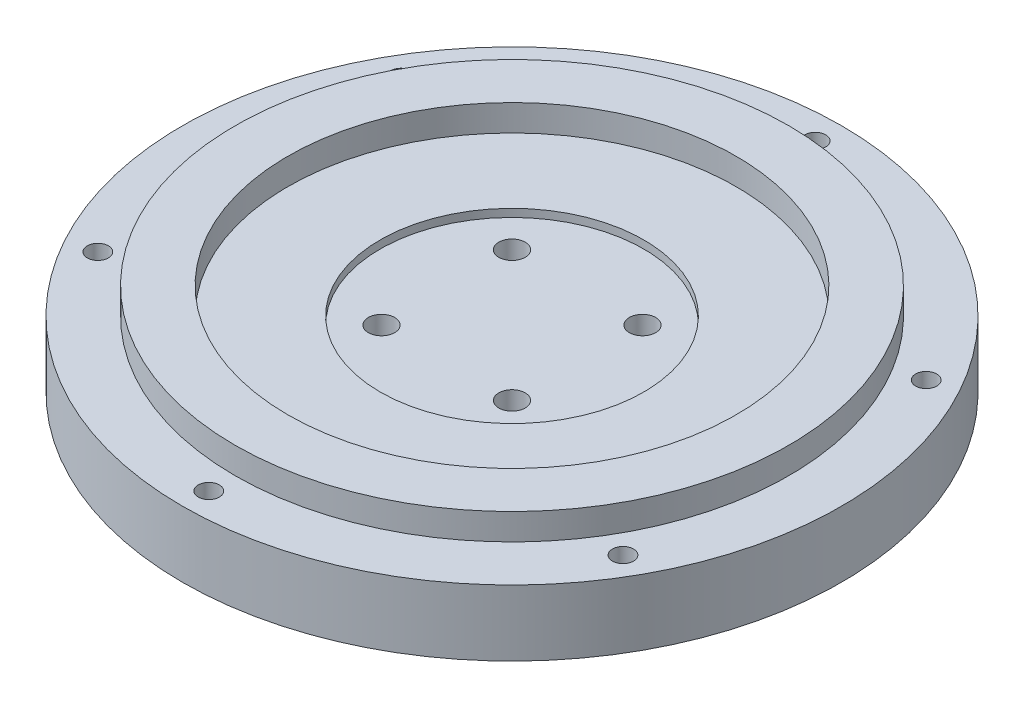
ISO-10303-21;
HEADER;
FILE_DESCRIPTION(('STEP AP214'),'2;1');
FILE_NAME('part.step','',(''),(''),'','','');
FILE_SCHEMA(('AUTOMOTIVE_DESIGN { 1 0 10303 214 1 1 1 1 }'));
ENDSEC;
DATA;
#1=APPLICATION_CONTEXT('core data for automotive mechanical design processes');
#2=APPLICATION_PROTOCOL_DEFINITION('international standard','automotive_design',2000,#1);
#3=PRODUCT_CONTEXT('',#1,'mechanical');
#4=PRODUCT('Part','Part','',(#3));
#5=PRODUCT_RELATED_PRODUCT_CATEGORY('part','',(#4));
#6=PRODUCT_DEFINITION_FORMATION('','',#4);
#7=PRODUCT_DEFINITION_CONTEXT('part definition',#1,'design');
#8=PRODUCT_DEFINITION('design','',#6,#7);
#9=PRODUCT_DEFINITION_SHAPE('','',#8);
#10=(LENGTH_UNIT() NAMED_UNIT(*) SI_UNIT(.MILLI.,.METRE.));
#11=(NAMED_UNIT(*) PLANE_ANGLE_UNIT() SI_UNIT($,.RADIAN.));
#12=(NAMED_UNIT(*) SI_UNIT($,.STERADIAN.) SOLID_ANGLE_UNIT());
#13=UNCERTAINTY_MEASURE_WITH_UNIT(LENGTH_MEASURE(1.E-05),#10,'distance_accuracy_value','');
#14=(GEOMETRIC_REPRESENTATION_CONTEXT(3) GLOBAL_UNCERTAINTY_ASSIGNED_CONTEXT((#13)) GLOBAL_UNIT_ASSIGNED_CONTEXT((#10,
#11,#12)) REPRESENTATION_CONTEXT('',''));
#15=CARTESIAN_POINT('',(0.,0.,0.));
#16=DIRECTION('',(0.,0.,1.));
#17=DIRECTION('',(1.,0.,0.));
#18=AXIS2_PLACEMENT_3D('',#15,#16,#17);
#19=CARTESIAN_POINT('',(0.,25.,0.));
#20=DIRECTION('',(0.,1.,0.));
#21=DIRECTION('',(0.,0.,1.));
#22=AXIS2_PLACEMENT_3D('',#19,#20,#21);
#23=PLANE('',#22);
#24=CARTESIAN_POINT('',(0.,25.,0.));
#25=DIRECTION('',(0.,1.,0.));
#26=DIRECTION('',(0.,0.,1.));
#27=AXIS2_PLACEMENT_3D('',#24,#25,#26);
#28=CIRCLE('',#27,50.);
#29=CARTESIAN_POINT('',(0.,25.,50.));
#30=VERTEX_POINT('',#29);
#31=EDGE_CURVE('E54',#30,#30,#28,.T.);
#32=ORIENTED_EDGE('',*,*,#31,.F.);
#33=EDGE_LOOP('',(#32));
#34=FACE_BOUND('',#33,.T.);
#35=CARTESIAN_POINT('',(0.,25.,0.));
#36=DIRECTION('',(0.,1.,0.));
#37=DIRECTION('',(0.,0.,1.));
#38=AXIS2_PLACEMENT_3D('',#35,#36,#37);
#39=CIRCLE('',#38,85.);
#40=CARTESIAN_POINT('',(0.,25.,85.));
#41=VERTEX_POINT('',#40);
#42=EDGE_CURVE('E414',#41,#41,#39,.T.);
#43=ORIENTED_EDGE('',*,*,#42,.T.);
#44=EDGE_LOOP('',(#43));
#45=FACE_BOUND('',#44,.T.);
#46=ADVANCED_FACE('F32',(#34,#45),#23,.T.);
#47=CARTESIAN_POINT('',(-24.7487373415292,39.142135623731,24.7487373415292));
#48=DIRECTION('',(0.,-1.,0.));
#49=DIRECTION('',(0.,0.,-1.));
#50=AXIS2_PLACEMENT_3D('',#47,#48,#49);
#51=CYLINDRICAL_SURFACE('',#50,5.);
#52=CARTESIAN_POINT('',(-24.7487373415292,10.,24.7487373415292));
#53=DIRECTION('',(0.,-1.,0.));
#54=DIRECTION('',(0.,0.,-1.));
#55=AXIS2_PLACEMENT_3D('',#52,#53,#54);
#56=CIRCLE('',#55,5.);
#57=CARTESIAN_POINT('',(-24.7487373415292,10.,19.7487373415292));
#58=VERTEX_POINT('',#57);
#59=EDGE_CURVE('E70',#58,#58,#56,.T.);
#60=ORIENTED_EDGE('',*,*,#59,.T.);
#61=EDGE_LOOP('',(#60));
#62=FACE_BOUND('',#61,.T.);
#63=CARTESIAN_POINT('',(-24.7487373415292,22.,24.7487373415292));
#64=DIRECTION('',(0.,1.,0.));
#65=DIRECTION('',(0.,0.,1.));
#66=AXIS2_PLACEMENT_3D('',#63,#64,#65);
#67=CIRCLE('',#66,5.);
#68=CARTESIAN_POINT('',(-24.7487373415292,22.,29.7487373415292));
#69=VERTEX_POINT('',#68);
#70=EDGE_CURVE('E63',#69,#69,#67,.F.);
#71=ORIENTED_EDGE('',*,*,#70,.F.);
#72=EDGE_LOOP('',(#71));
#73=FACE_BOUND('',#72,.T.);
#74=ADVANCED_FACE('F175',(#62,#73),#51,.F.);
#75=CARTESIAN_POINT('',(24.7487373415292,39.142135623731,24.7487373415292));
#76=DIRECTION('',(0.,-1.,0.));
#77=DIRECTION('',(0.,0.,-1.));
#78=AXIS2_PLACEMENT_3D('',#75,#76,#77);
#79=CYLINDRICAL_SURFACE('',#78,5.);
#80=CARTESIAN_POINT('',(24.7487373415292,10.,24.7487373415292));
#81=DIRECTION('',(0.,-1.,0.));
#82=DIRECTION('',(0.,0.,-1.));
#83=AXIS2_PLACEMENT_3D('',#80,#81,#82);
#84=CIRCLE('',#83,5.);
#85=CARTESIAN_POINT('',(24.7487373415292,10.,19.7487373415292));
#86=VERTEX_POINT('',#85);
#87=EDGE_CURVE('E67',#86,#86,#84,.T.);
#88=ORIENTED_EDGE('',*,*,#87,.T.);
#89=EDGE_LOOP('',(#88));
#90=FACE_BOUND('',#89,.T.);
#91=CARTESIAN_POINT('',(24.7487373415292,22.,24.7487373415292));
#92=DIRECTION('',(0.,1.,0.));
#93=DIRECTION('',(0.,0.,1.));
#94=AXIS2_PLACEMENT_3D('',#91,#92,#93);
#95=CIRCLE('',#94,5.);
#96=CARTESIAN_POINT('',(24.7487373415292,22.,29.7487373415292));
#97=VERTEX_POINT('',#96);
#98=EDGE_CURVE('E60',#97,#97,#95,.F.);
#99=ORIENTED_EDGE('',*,*,#98,.F.);
#100=EDGE_LOOP('',(#99));
#101=FACE_BOUND('',#100,.T.);
#102=ADVANCED_FACE('F181',(#90,#101),#79,.F.);
#103=CARTESIAN_POINT('',(24.7487373415292,39.142135623731,-24.7487373415292));
#104=DIRECTION('',(0.,-1.,0.));
#105=DIRECTION('',(0.,0.,-1.));
#106=AXIS2_PLACEMENT_3D('',#103,#104,#105);
#107=CYLINDRICAL_SURFACE('',#106,5.);
#108=CARTESIAN_POINT('',(24.7487373415292,10.,-24.7487373415292));
#109=DIRECTION('',(0.,-1.,0.));
#110=DIRECTION('',(0.,0.,-1.));
#111=AXIS2_PLACEMENT_3D('',#108,#109,#110);
#112=CIRCLE('',#111,5.);
#113=CARTESIAN_POINT('',(24.7487373415292,10.,-29.7487373415292));
#114=VERTEX_POINT('',#113);
#115=EDGE_CURVE('E71',#114,#114,#112,.T.);
#116=ORIENTED_EDGE('',*,*,#115,.T.);
#117=EDGE_LOOP('',(#116));
#118=FACE_BOUND('',#117,.T.);
#119=CARTESIAN_POINT('',(24.7487373415292,22.,-24.7487373415292));
#120=DIRECTION('',(0.,1.,0.));
#121=DIRECTION('',(0.,0.,1.));
#122=AXIS2_PLACEMENT_3D('',#119,#120,#121);
#123=CIRCLE('',#122,5.);
#124=CARTESIAN_POINT('',(24.7487373415292,22.,-19.7487373415292));
#125=VERTEX_POINT('',#124);
#126=EDGE_CURVE('E57',#125,#125,#123,.F.);
#127=ORIENTED_EDGE('',*,*,#126,.F.);
#128=EDGE_LOOP('',(#127));
#129=FACE_BOUND('',#128,.T.);
#130=ADVANCED_FACE('F193',(#118,#129),#107,.F.);
#131=CARTESIAN_POINT('',(-24.7487373415292,39.142135623731,-24.7487373415292));
#132=DIRECTION('',(0.,-1.,0.));
#133=DIRECTION('',(0.,0.,-1.));
#134=AXIS2_PLACEMENT_3D('',#131,#132,#133);
#135=CYLINDRICAL_SURFACE('',#134,5.);
#136=CARTESIAN_POINT('',(-24.7487373415292,10.,-24.7487373415292));
#137=DIRECTION('',(0.,-1.,0.));
#138=DIRECTION('',(0.,0.,-1.));
#139=AXIS2_PLACEMENT_3D('',#136,#137,#138);
#140=CIRCLE('',#139,5.);
#141=CARTESIAN_POINT('',(-24.7487373415292,10.,-29.7487373415292));
#142=VERTEX_POINT('',#141);
#143=EDGE_CURVE('E66',#142,#142,#140,.T.);
#144=ORIENTED_EDGE('',*,*,#143,.T.);
#145=EDGE_LOOP('',(#144));
#146=FACE_BOUND('',#145,.T.);
#147=CARTESIAN_POINT('',(-24.7487373415292,22.,-24.7487373415292));
#148=DIRECTION('',(0.,1.,0.));
#149=DIRECTION('',(0.,0.,1.));
#150=AXIS2_PLACEMENT_3D('',#147,#148,#149);
#151=CIRCLE('',#150,5.);
#152=CARTESIAN_POINT('',(-24.7487373415292,22.,-19.7487373415292));
#153=VERTEX_POINT('',#152);
#154=EDGE_CURVE('E36',#153,#153,#151,.F.);
#155=ORIENTED_EDGE('',*,*,#154,.F.);
#156=EDGE_LOOP('',(#155));
#157=FACE_BOUND('',#156,.T.);
#158=ADVANCED_FACE('F188',(#146,#157),#135,.F.);
#159=CARTESIAN_POINT('',(0.,25.,0.));
#160=DIRECTION('',(0.,1.,0.));
#161=DIRECTION('',(0.,0.,1.));
#162=AXIS2_PLACEMENT_3D('',#159,#160,#161);
#163=CIRCLE('',#162,105.);
#164=CARTESIAN_POINT('',(0.,25.,105.));
#165=VERTEX_POINT('',#164);
#166=EDGE_CURVE('E10',#165,#165,#163,.T.);
#167=ORIENTED_EDGE('',*,*,#166,.F.);
#168=EDGE_LOOP('',(#167));
#169=FACE_BOUND('',#168,.T.);
#170=CARTESIAN_POINT('',(-99.5929214352031,25.,57.5000000000043));
#171=DIRECTION('',(0.,1.,0.));
#172=DIRECTION('',(0.,0.,1.));
#173=AXIS2_PLACEMENT_3D('',#170,#171,#172);
#174=CIRCLE('',#173,4.00000000001161);
#175=CARTESIAN_POINT('',(-99.5929214352031,25.,61.5000000000159));
#176=VERTEX_POINT('',#175);
#177=EDGE_CURVE('E109',#176,#176,#174,.T.);
#178=ORIENTED_EDGE('',*,*,#177,.F.);
#179=EDGE_LOOP('',(#178));
#180=FACE_BOUND('',#179,.T.);
#181=CARTESIAN_POINT('',(99.5929214352178,25.,57.4999999999958));
#182=DIRECTION('',(0.,1.,0.));
#183=DIRECTION('',(0.,0.,1.));
#184=AXIS2_PLACEMENT_3D('',#181,#182,#183);
#185=CIRCLE('',#184,4.00000000000822);
#186=CARTESIAN_POINT('',(99.5929214352178,25.,61.500000000004));
#187=VERTEX_POINT('',#186);
#188=EDGE_CURVE('E121',#187,#187,#185,.T.);
#189=ORIENTED_EDGE('',*,*,#188,.F.);
#190=EDGE_LOOP('',(#189));
#191=FACE_BOUND('',#190,.T.);
#192=CARTESIAN_POINT('',(0.,25.,-115.));
#193=DIRECTION('',(0.,1.,0.));
#194=DIRECTION('',(0.,0.,1.));
#195=AXIS2_PLACEMENT_3D('',#192,#193,#194);
#196=CIRCLE('',#195,4.);
#197=CARTESIAN_POINT('',(0.,25.,-111.));
#198=VERTEX_POINT('',#197);
#199=EDGE_CURVE('E133',#198,#198,#196,.T.);
#200=ORIENTED_EDGE('',*,*,#199,.F.);
#201=EDGE_LOOP('',(#200));
#202=FACE_BOUND('',#201,.T.);
#203=CARTESIAN_POINT('',(0.,25.,0.));
#204=DIRECTION('',(0.,1.,0.));
#205=DIRECTION('',(0.,0.,1.));
#206=AXIS2_PLACEMENT_3D('',#203,#204,#205);
#207=CIRCLE('',#206,125.);
#208=CARTESIAN_POINT('',(0.,25.,125.));
#209=VERTEX_POINT('',#208);
#210=EDGE_CURVE('E40',#209,#209,#207,.T.);
#211=ORIENTED_EDGE('',*,*,#210,.T.);
#212=EDGE_LOOP('',(#211));
#213=FACE_BOUND('',#212,.T.);
#214=CARTESIAN_POINT('',(99.5929214352129,25.,-57.5000000000043));
#215=DIRECTION('',(0.,1.,0.));
#216=DIRECTION('',(0.,0.,1.));
#217=AXIS2_PLACEMENT_3D('',#214,#215,#216);
#218=CIRCLE('',#217,4.00000000000314);
#219=CARTESIAN_POINT('',(99.5929214352129,25.,-53.5000000000011));
#220=VERTEX_POINT('',#219);
#221=EDGE_CURVE('E127',#220,#220,#218,.T.);
#222=ORIENTED_EDGE('',*,*,#221,.F.);
#223=EDGE_LOOP('',(#222));
#224=FACE_BOUND('',#223,.T.);
#225=CARTESIAN_POINT('',(9.77732287710899E-12,25.,115.));
#226=DIRECTION('',(0.,1.,0.));
#227=DIRECTION('',(0.,0.,1.));
#228=AXIS2_PLACEMENT_3D('',#225,#226,#227);
#229=CIRCLE('',#228,4.00000000001225);
#230=CARTESIAN_POINT('',(9.77732287710899E-12,25.,119.000000000012));
#231=VERTEX_POINT('',#230);
#232=EDGE_CURVE('E115',#231,#231,#229,.T.);
#233=ORIENTED_EDGE('',*,*,#232,.F.);
#234=EDGE_LOOP('',(#233));
#235=FACE_BOUND('',#234,.T.);
#236=CARTESIAN_POINT('',(-99.5929214352081,25.,-57.4999999999957));
#237=DIRECTION('',(0.,1.,0.));
#238=DIRECTION('',(0.,0.,1.));
#239=AXIS2_PLACEMENT_3D('',#236,#237,#238);
#240=CIRCLE('',#239,4.00000000000591);
#241=CARTESIAN_POINT('',(-99.5929214352081,25.,-53.4999999999898));
#242=VERTEX_POINT('',#241);
#243=EDGE_CURVE('E103',#242,#242,#240,.T.);
#244=ORIENTED_EDGE('',*,*,#243,.F.);
#245=EDGE_LOOP('',(#244));
#246=FACE_BOUND('',#245,.T.);
#247=ADVANCED_FACE('F144',(#169,#180,#191,#202,#213,#224,#235,#246),#23,.T.);
#248=CARTESIAN_POINT('',(0.,0.,0.));
#249=DIRECTION('',(0.,1.,0.));
#250=DIRECTION('',(0.,0.,1.));
#251=AXIS2_PLACEMENT_3D('',#248,#249,#250);
#252=PLANE('',#251);
#253=CARTESIAN_POINT('',(-24.7487373415292,0.,-24.7487373415292));
#254=DIRECTION('',(0.,-1.,0.));
#255=DIRECTION('',(0.,0.,-1.));
#256=AXIS2_PLACEMENT_3D('',#253,#254,#255);
#257=CIRCLE('',#256,9.);
#258=CARTESIAN_POINT('',(-24.7487373415292,0.,-33.7487373415292));
#259=VERTEX_POINT('',#258);
#260=EDGE_CURVE('E78',#259,#259,#257,.T.);
#261=ORIENTED_EDGE('',*,*,#260,.F.);
#262=EDGE_LOOP('',(#261));
#263=FACE_BOUND('',#262,.T.);
#264=CARTESIAN_POINT('',(24.7487373415292,0.,-24.7487373415292));
#265=DIRECTION('',(0.,-1.,0.));
#266=DIRECTION('',(0.,0.,-1.));
#267=AXIS2_PLACEMENT_3D('',#264,#265,#266);
#268=CIRCLE('',#267,9.);
#269=CARTESIAN_POINT('',(24.7487373415292,0.,-33.7487373415292));
#270=VERTEX_POINT('',#269);
#271=EDGE_CURVE('E89',#270,#270,#268,.T.);
#272=ORIENTED_EDGE('',*,*,#271,.F.);
#273=EDGE_LOOP('',(#272));
#274=FACE_BOUND('',#273,.T.);
#275=CARTESIAN_POINT('',(24.7487373415292,0.,24.7487373415292));
#276=DIRECTION('',(0.,-1.,0.));
#277=DIRECTION('',(0.,0.,-1.));
#278=AXIS2_PLACEMENT_3D('',#275,#276,#277);
#279=CIRCLE('',#278,9.);
#280=CARTESIAN_POINT('',(24.7487373415292,0.,15.7487373415292));
#281=VERTEX_POINT('',#280);
#282=EDGE_CURVE('E83',#281,#281,#279,.T.);
#283=ORIENTED_EDGE('',*,*,#282,.F.);
#284=EDGE_LOOP('',(#283));
#285=FACE_BOUND('',#284,.T.);
#286=CARTESIAN_POINT('',(-24.7487373415292,0.,24.7487373415292));
#287=DIRECTION('',(0.,-1.,0.));
#288=DIRECTION('',(0.,0.,-1.));
#289=AXIS2_PLACEMENT_3D('',#286,#287,#288);
#290=CIRCLE('',#289,9.);
#291=CARTESIAN_POINT('',(-24.7487373415292,0.,15.7487373415292));
#292=VERTEX_POINT('',#291);
#293=EDGE_CURVE('E82',#292,#292,#290,.T.);
#294=ORIENTED_EDGE('',*,*,#293,.F.);
#295=EDGE_LOOP('',(#294));
#296=FACE_BOUND('',#295,.T.);
#297=CARTESIAN_POINT('',(0.,0.,0.));
#298=DIRECTION('',(0.,1.,0.));
#299=DIRECTION('',(0.,0.,1.));
#300=AXIS2_PLACEMENT_3D('',#297,#298,#299);
#301=CIRCLE('',#300,125.);
#302=CARTESIAN_POINT('',(0.,0.,125.));
#303=VERTEX_POINT('',#302);
#304=EDGE_CURVE('E45',#303,#303,#301,.T.);
#305=ORIENTED_EDGE('',*,*,#304,.F.);
#306=EDGE_LOOP('',(#305));
#307=FACE_BOUND('',#306,.T.);
#308=CARTESIAN_POINT('',(0.,0.,-115.));
#309=DIRECTION('',(0.,1.,0.));
#310=DIRECTION('',(0.,0.,1.));
#311=AXIS2_PLACEMENT_3D('',#308,#309,#310);
#312=CIRCLE('',#311,4.);
#313=CARTESIAN_POINT('',(0.,0.,-111.));
#314=VERTEX_POINT('',#313);
#315=EDGE_CURVE('E130',#314,#314,#312,.T.);
#316=ORIENTED_EDGE('',*,*,#315,.T.);
#317=EDGE_LOOP('',(#316));
#318=FACE_BOUND('',#317,.T.);
#319=CARTESIAN_POINT('',(99.5929214352129,0.,-57.5000000000043));
#320=DIRECTION('',(0.,1.,0.));
#321=DIRECTION('',(0.,0.,1.));
#322=AXIS2_PLACEMENT_3D('',#319,#320,#321);
#323=CIRCLE('',#322,4.00000000000314);
#324=CARTESIAN_POINT('',(99.5929214352129,0.,-53.5000000000011));
#325=VERTEX_POINT('',#324);
#326=EDGE_CURVE('E124',#325,#325,#323,.T.);
#327=ORIENTED_EDGE('',*,*,#326,.T.);
#328=EDGE_LOOP('',(#327));
#329=FACE_BOUND('',#328,.T.);
#330=CARTESIAN_POINT('',(99.5929214352178,0.,57.4999999999958));
#331=DIRECTION('',(0.,1.,0.));
#332=DIRECTION('',(0.,0.,1.));
#333=AXIS2_PLACEMENT_3D('',#330,#331,#332);
#334=CIRCLE('',#333,4.00000000000822);
#335=CARTESIAN_POINT('',(99.5929214352178,0.,61.500000000004));
#336=VERTEX_POINT('',#335);
#337=EDGE_CURVE('E118',#336,#336,#334,.T.);
#338=ORIENTED_EDGE('',*,*,#337,.T.);
#339=EDGE_LOOP('',(#338));
#340=FACE_BOUND('',#339,.T.);
#341=CARTESIAN_POINT('',(9.77732287710899E-12,0.,115.));
#342=DIRECTION('',(0.,1.,0.));
#343=DIRECTION('',(0.,0.,1.));
#344=AXIS2_PLACEMENT_3D('',#341,#342,#343);
#345=CIRCLE('',#344,4.00000000001225);
#346=CARTESIAN_POINT('',(9.77732287710899E-12,0.,119.000000000012));
#347=VERTEX_POINT('',#346);
#348=EDGE_CURVE('E112',#347,#347,#345,.T.);
#349=ORIENTED_EDGE('',*,*,#348,.T.);
#350=EDGE_LOOP('',(#349));
#351=FACE_BOUND('',#350,.T.);
#352=CARTESIAN_POINT('',(-99.5929214352031,0.,57.5000000000043));
#353=DIRECTION('',(0.,1.,0.));
#354=DIRECTION('',(0.,0.,1.));
#355=AXIS2_PLACEMENT_3D('',#352,#353,#354);
#356=CIRCLE('',#355,4.00000000001161);
#357=CARTESIAN_POINT('',(-99.5929214352031,0.,61.5000000000159));
#358=VERTEX_POINT('',#357);
#359=EDGE_CURVE('E106',#358,#358,#356,.T.);
#360=ORIENTED_EDGE('',*,*,#359,.T.);
#361=EDGE_LOOP('',(#360));
#362=FACE_BOUND('',#361,.T.);
#363=CARTESIAN_POINT('',(-99.5929214352081,0.,-57.4999999999957));
#364=DIRECTION('',(0.,1.,0.));
#365=DIRECTION('',(0.,0.,1.));
#366=AXIS2_PLACEMENT_3D('',#363,#364,#365);
#367=CIRCLE('',#366,4.00000000000591);
#368=CARTESIAN_POINT('',(-99.5929214352081,0.,-53.4999999999898));
#369=VERTEX_POINT('',#368);
#370=EDGE_CURVE('E100',#369,#369,#367,.T.);
#371=ORIENTED_EDGE('',*,*,#370,.T.);
#372=EDGE_LOOP('',(#371));
#373=FACE_BOUND('',#372,.T.);
#374=ADVANCED_FACE('F141',(#263,#274,#285,#296,#307,#318,#329,#340,#351,#362,#373),#252,.F.);
#375=CARTESIAN_POINT('',(0.,25.,0.));
#376=DIRECTION('',(0.,-1.,0.));
#377=DIRECTION('',(0.,0.,-1.));
#378=AXIS2_PLACEMENT_3D('',#375,#376,#377);
#379=CYLINDRICAL_SURFACE('',#378,125.);
#380=ORIENTED_EDGE('',*,*,#210,.F.);
#381=EDGE_LOOP('',(#380));
#382=FACE_BOUND('',#381,.T.);
#383=ORIENTED_EDGE('',*,*,#304,.T.);
#384=EDGE_LOOP('',(#383));
#385=FACE_BOUND('',#384,.T.);
#386=ADVANCED_FACE('F34',(#382,#385),#379,.T.);
#387=CARTESIAN_POINT('',(0.,25.,-115.));
#388=DIRECTION('',(0.,-1.,0.));
#389=DIRECTION('',(0.,0.,-1.));
#390=AXIS2_PLACEMENT_3D('',#387,#388,#389);
#391=CYLINDRICAL_SURFACE('',#390,4.);
#392=ORIENTED_EDGE('',*,*,#199,.T.);
#393=EDGE_LOOP('',(#392));
#394=FACE_BOUND('',#393,.T.);
#395=ORIENTED_EDGE('',*,*,#315,.F.);
#396=EDGE_LOOP('',(#395));
#397=FACE_BOUND('',#396,.T.);
#398=ADVANCED_FACE('F223',(#394,#397),#391,.F.);
#399=CARTESIAN_POINT('',(99.5929214352129,25.,-57.5000000000043));
#400=DIRECTION('',(0.,-1.,0.));
#401=DIRECTION('',(0.,0.,-1.));
#402=AXIS2_PLACEMENT_3D('',#399,#400,#401);
#403=CYLINDRICAL_SURFACE('',#402,4.00000000000314);
#404=ORIENTED_EDGE('',*,*,#221,.T.);
#405=EDGE_LOOP('',(#404));
#406=FACE_BOUND('',#405,.T.);
#407=ORIENTED_EDGE('',*,*,#326,.F.);
#408=EDGE_LOOP('',(#407));
#409=FACE_BOUND('',#408,.T.);
#410=ADVANCED_FACE('F218',(#406,#409),#403,.F.);
#411=CARTESIAN_POINT('',(99.5929214352178,25.,57.4999999999958));
#412=DIRECTION('',(0.,-1.,0.));
#413=DIRECTION('',(0.,0.,-1.));
#414=AXIS2_PLACEMENT_3D('',#411,#412,#413);
#415=CYLINDRICAL_SURFACE('',#414,4.00000000000822);
#416=ORIENTED_EDGE('',*,*,#188,.T.);
#417=EDGE_LOOP('',(#416));
#418=FACE_BOUND('',#417,.T.);
#419=ORIENTED_EDGE('',*,*,#337,.F.);
#420=EDGE_LOOP('',(#419));
#421=FACE_BOUND('',#420,.T.);
#422=ADVANCED_FACE('F213',(#418,#421),#415,.F.);
#423=CARTESIAN_POINT('',(9.77732287710899E-12,25.,115.));
#424=DIRECTION('',(0.,-1.,0.));
#425=DIRECTION('',(0.,0.,-1.));
#426=AXIS2_PLACEMENT_3D('',#423,#424,#425);
#427=CYLINDRICAL_SURFACE('',#426,4.00000000001225);
#428=ORIENTED_EDGE('',*,*,#232,.T.);
#429=EDGE_LOOP('',(#428));
#430=FACE_BOUND('',#429,.T.);
#431=ORIENTED_EDGE('',*,*,#348,.F.);
#432=EDGE_LOOP('',(#431));
#433=FACE_BOUND('',#432,.T.);
#434=ADVANCED_FACE('F171',(#430,#433),#427,.F.);
#435=CARTESIAN_POINT('',(-99.5929214352031,25.,57.5000000000043));
#436=DIRECTION('',(0.,-1.,0.));
#437=DIRECTION('',(0.,0.,-1.));
#438=AXIS2_PLACEMENT_3D('',#435,#436,#437);
#439=CYLINDRICAL_SURFACE('',#438,4.00000000001161);
#440=ORIENTED_EDGE('',*,*,#177,.T.);
#441=EDGE_LOOP('',(#440));
#442=FACE_BOUND('',#441,.T.);
#443=ORIENTED_EDGE('',*,*,#359,.F.);
#444=EDGE_LOOP('',(#443));
#445=FACE_BOUND('',#444,.T.);
#446=ADVANCED_FACE('F161',(#442,#445),#439,.F.);
#447=CARTESIAN_POINT('',(-99.5929214352081,25.,-57.4999999999957));
#448=DIRECTION('',(0.,-1.,0.));
#449=DIRECTION('',(0.,0.,-1.));
#450=AXIS2_PLACEMENT_3D('',#447,#448,#449);
#451=CYLINDRICAL_SURFACE('',#450,4.00000000000591);
#452=ORIENTED_EDGE('',*,*,#243,.T.);
#453=EDGE_LOOP('',(#452));
#454=FACE_BOUND('',#453,.T.);
#455=ORIENTED_EDGE('',*,*,#370,.F.);
#456=EDGE_LOOP('',(#455));
#457=FACE_BOUND('',#456,.T.);
#458=ADVANCED_FACE('F158',(#454,#457),#451,.F.);
#459=CARTESIAN_POINT('',(-24.7487373415292,10.,24.7487373415292));
#460=DIRECTION('',(0.,-1.,0.));
#461=DIRECTION('',(0.,0.,-1.));
#462=AXIS2_PLACEMENT_3D('',#459,#460,#461);
#463=CYLINDRICAL_SURFACE('',#462,9.);
#464=CARTESIAN_POINT('',(-24.7487373415292,10.,24.7487373415292));
#465=DIRECTION('',(0.,-1.,0.));
#466=DIRECTION('',(0.,0.,-1.));
#467=AXIS2_PLACEMENT_3D('',#464,#465,#466);
#468=CIRCLE('',#467,9.);
#469=CARTESIAN_POINT('',(-24.7487373415292,10.,15.7487373415292));
#470=VERTEX_POINT('',#469);
#471=EDGE_CURVE('E97',#470,#470,#468,.T.);
#472=ORIENTED_EDGE('',*,*,#471,.F.);
#473=EDGE_LOOP('',(#472));
#474=FACE_BOUND('',#473,.T.);
#475=ORIENTED_EDGE('',*,*,#293,.T.);
#476=EDGE_LOOP('',(#475));
#477=FACE_BOUND('',#476,.T.);
#478=ADVANCED_FACE('F160',(#474,#477),#463,.F.);
#479=CARTESIAN_POINT('',(-24.7487373415292,10.,24.7487373415292));
#480=DIRECTION('',(0.,-1.,0.));
#481=DIRECTION('',(0.,0.,-1.));
#482=AXIS2_PLACEMENT_3D('',#479,#480,#481);
#483=PLANE('',#482);
#484=ORIENTED_EDGE('',*,*,#59,.F.);
#485=EDGE_LOOP('',(#484));
#486=FACE_BOUND('',#485,.T.);
#487=ORIENTED_EDGE('',*,*,#471,.T.);
#488=EDGE_LOOP('',(#487));
#489=FACE_BOUND('',#488,.T.);
#490=ADVANCED_FACE('F168',(#486,#489),#483,.T.);
#491=CARTESIAN_POINT('',(24.7487373415292,10.,24.7487373415292));
#492=DIRECTION('',(0.,-1.,0.));
#493=DIRECTION('',(0.,0.,-1.));
#494=AXIS2_PLACEMENT_3D('',#491,#492,#493);
#495=CYLINDRICAL_SURFACE('',#494,9.);
#496=CARTESIAN_POINT('',(24.7487373415292,10.,24.7487373415292));
#497=DIRECTION('',(0.,-1.,0.));
#498=DIRECTION('',(0.,0.,-1.));
#499=AXIS2_PLACEMENT_3D('',#496,#497,#498);
#500=CIRCLE('',#499,9.);
#501=CARTESIAN_POINT('',(24.7487373415292,10.,15.7487373415292));
#502=VERTEX_POINT('',#501);
#503=EDGE_CURVE('E79',#502,#502,#500,.T.);
#504=ORIENTED_EDGE('',*,*,#503,.F.);
#505=EDGE_LOOP('',(#504));
#506=FACE_BOUND('',#505,.T.);
#507=ORIENTED_EDGE('',*,*,#282,.T.);
#508=EDGE_LOOP('',(#507));
#509=FACE_BOUND('',#508,.T.);
#510=ADVANCED_FACE('F255',(#506,#509),#495,.F.);
#511=CARTESIAN_POINT('',(24.7487373415292,10.,24.7487373415292));
#512=DIRECTION('',(0.,-1.,0.));
#513=DIRECTION('',(0.,0.,-1.));
#514=AXIS2_PLACEMENT_3D('',#511,#512,#513);
#515=PLANE('',#514);
#516=ORIENTED_EDGE('',*,*,#87,.F.);
#517=EDGE_LOOP('',(#516));
#518=FACE_BOUND('',#517,.T.);
#519=ORIENTED_EDGE('',*,*,#503,.T.);
#520=EDGE_LOOP('',(#519));
#521=FACE_BOUND('',#520,.T.);
#522=ADVANCED_FACE('F260',(#518,#521),#515,.T.);
#523=CARTESIAN_POINT('',(24.7487373415292,10.,-24.7487373415292));
#524=DIRECTION('',(0.,-1.,0.));
#525=DIRECTION('',(0.,0.,-1.));
#526=AXIS2_PLACEMENT_3D('',#523,#524,#525);
#527=CYLINDRICAL_SURFACE('',#526,9.);
#528=CARTESIAN_POINT('',(24.7487373415292,10.,-24.7487373415292));
#529=DIRECTION('',(0.,-1.,0.));
#530=DIRECTION('',(0.,0.,-1.));
#531=AXIS2_PLACEMENT_3D('',#528,#529,#530);
#532=CIRCLE('',#531,9.);
#533=CARTESIAN_POINT('',(24.7487373415292,10.,-33.7487373415292));
#534=VERTEX_POINT('',#533);
#535=EDGE_CURVE('E86',#534,#534,#532,.T.);
#536=ORIENTED_EDGE('',*,*,#535,.F.);
#537=EDGE_LOOP('',(#536));
#538=FACE_BOUND('',#537,.T.);
#539=ORIENTED_EDGE('',*,*,#271,.T.);
#540=EDGE_LOOP('',(#539));
#541=FACE_BOUND('',#540,.T.);
#542=ADVANCED_FACE('F268',(#538,#541),#527,.F.);
#543=CARTESIAN_POINT('',(24.7487373415292,10.,-24.7487373415292));
#544=DIRECTION('',(0.,-1.,0.));
#545=DIRECTION('',(0.,0.,-1.));
#546=AXIS2_PLACEMENT_3D('',#543,#544,#545);
#547=PLANE('',#546);
#548=ORIENTED_EDGE('',*,*,#115,.F.);
#549=EDGE_LOOP('',(#548));
#550=FACE_BOUND('',#549,.T.);
#551=ORIENTED_EDGE('',*,*,#535,.T.);
#552=EDGE_LOOP('',(#551));
#553=FACE_BOUND('',#552,.T.);
#554=ADVANCED_FACE('F273',(#550,#553),#547,.T.);
#555=CARTESIAN_POINT('',(-24.7487373415292,10.,-24.7487373415292));
#556=DIRECTION('',(0.,-1.,0.));
#557=DIRECTION('',(0.,0.,-1.));
#558=AXIS2_PLACEMENT_3D('',#555,#556,#557);
#559=CYLINDRICAL_SURFACE('',#558,9.);
#560=CARTESIAN_POINT('',(-24.7487373415292,10.,-24.7487373415292));
#561=DIRECTION('',(0.,-1.,0.));
#562=DIRECTION('',(0.,0.,-1.));
#563=AXIS2_PLACEMENT_3D('',#560,#561,#562);
#564=CIRCLE('',#563,9.);
#565=CARTESIAN_POINT('',(-24.7487373415292,10.,-33.7487373415292));
#566=VERTEX_POINT('',#565);
#567=EDGE_CURVE('E92',#566,#566,#564,.T.);
#568=ORIENTED_EDGE('',*,*,#567,.F.);
#569=EDGE_LOOP('',(#568));
#570=FACE_BOUND('',#569,.T.);
#571=ORIENTED_EDGE('',*,*,#260,.T.);
#572=EDGE_LOOP('',(#571));
#573=FACE_BOUND('',#572,.T.);
#574=ADVANCED_FACE('F281',(#570,#573),#559,.F.);
#575=CARTESIAN_POINT('',(-24.7487373415292,10.,-24.7487373415292));
#576=DIRECTION('',(0.,-1.,0.));
#577=DIRECTION('',(0.,0.,-1.));
#578=AXIS2_PLACEMENT_3D('',#575,#576,#577);
#579=PLANE('',#578);
#580=ORIENTED_EDGE('',*,*,#143,.F.);
#581=EDGE_LOOP('',(#580));
#582=FACE_BOUND('',#581,.T.);
#583=ORIENTED_EDGE('',*,*,#567,.T.);
#584=EDGE_LOOP('',(#583));
#585=FACE_BOUND('',#584,.T.);
#586=ADVANCED_FACE('F286',(#582,#585),#579,.T.);
#587=CARTESIAN_POINT('',(0.,22.,0.));
#588=DIRECTION('',(0.,1.,0.));
#589=DIRECTION('',(0.,0.,1.));
#590=AXIS2_PLACEMENT_3D('',#587,#588,#589);
#591=PLANE('',#590);
#592=CARTESIAN_POINT('',(0.,22.,0.));
#593=DIRECTION('',(0.,1.,0.));
#594=DIRECTION('',(0.,0.,1.));
#595=AXIS2_PLACEMENT_3D('',#592,#593,#594);
#596=CIRCLE('',#595,50.);
#597=CARTESIAN_POINT('',(0.,22.,50.));
#598=VERTEX_POINT('',#597);
#599=EDGE_CURVE('E51',#598,#598,#596,.T.);
#600=ORIENTED_EDGE('',*,*,#599,.T.);
#601=EDGE_LOOP('',(#600));
#602=FACE_BOUND('',#601,.T.);
#603=ORIENTED_EDGE('',*,*,#154,.T.);
#604=EDGE_LOOP('',(#603));
#605=FACE_BOUND('',#604,.T.);
#606=ORIENTED_EDGE('',*,*,#126,.T.);
#607=EDGE_LOOP('',(#606));
#608=FACE_BOUND('',#607,.T.);
#609=ORIENTED_EDGE('',*,*,#98,.T.);
#610=EDGE_LOOP('',(#609));
#611=FACE_BOUND('',#610,.T.);
#612=ORIENTED_EDGE('',*,*,#70,.T.);
#613=EDGE_LOOP('',(#612));
#614=FACE_BOUND('',#613,.T.);
#615=ADVANCED_FACE('F317',(#602,#605,#608,#611,#614),#591,.T.);
#616=CARTESIAN_POINT('',(0.,22.,0.));
#617=DIRECTION('',(0.,1.,0.));
#618=DIRECTION('',(0.,0.,1.));
#619=AXIS2_PLACEMENT_3D('',#616,#617,#618);
#620=CYLINDRICAL_SURFACE('',#619,50.);
#621=ORIENTED_EDGE('',*,*,#599,.F.);
#622=EDGE_LOOP('',(#621));
#623=FACE_BOUND('',#622,.T.);
#624=ORIENTED_EDGE('',*,*,#31,.T.);
#625=EDGE_LOOP('',(#624));
#626=FACE_BOUND('',#625,.T.);
#627=ADVANCED_FACE('F357',(#623,#626),#620,.F.);
#628=CARTESIAN_POINT('',(0.,35.,0.));
#629=DIRECTION('',(0.,1.,0.));
#630=DIRECTION('',(0.,0.,1.));
#631=AXIS2_PLACEMENT_3D('',#628,#629,#630);
#632=PLANE('',#631);
#633=CARTESIAN_POINT('',(0.,35.,0.));
#634=DIRECTION('',(0.,1.,0.));
#635=DIRECTION('',(0.,0.,1.));
#636=AXIS2_PLACEMENT_3D('',#633,#634,#635);
#637=CIRCLE('',#636,105.);
#638=CARTESIAN_POINT('',(0.,35.,105.));
#639=VERTEX_POINT('',#638);
#640=EDGE_CURVE('E49',#639,#639,#637,.T.);
#641=ORIENTED_EDGE('',*,*,#640,.T.);
#642=EDGE_LOOP('',(#641));
#643=FACE_BOUND('',#642,.T.);
#644=CARTESIAN_POINT('',(0.,35.,0.));
#645=DIRECTION('',(0.,1.,0.));
#646=DIRECTION('',(0.,0.,1.));
#647=AXIS2_PLACEMENT_3D('',#644,#645,#646);
#648=CIRCLE('',#647,85.);
#649=CARTESIAN_POINT('',(0.,35.,85.));
#650=VERTEX_POINT('',#649);
#651=EDGE_CURVE('E411',#650,#650,#648,.T.);
#652=ORIENTED_EDGE('',*,*,#651,.F.);
#653=EDGE_LOOP('',(#652));
#654=FACE_BOUND('',#653,.T.);
#655=ADVANCED_FACE('F366',(#643,#654),#632,.T.);
#656=CARTESIAN_POINT('',(0.,35.,0.));
#657=DIRECTION('',(0.,-1.,0.));
#658=DIRECTION('',(0.,0.,-1.));
#659=AXIS2_PLACEMENT_3D('',#656,#657,#658);
#660=CYLINDRICAL_SURFACE('',#659,105.);
#661=ORIENTED_EDGE('',*,*,#640,.F.);
#662=EDGE_LOOP('',(#661));
#663=FACE_BOUND('',#662,.T.);
#664=ORIENTED_EDGE('',*,*,#166,.T.);
#665=EDGE_LOOP('',(#664));
#666=FACE_BOUND('',#665,.T.);
#667=ADVANCED_FACE('F384',(#663,#666),#660,.T.);
#668=CARTESIAN_POINT('',(0.,35.,0.));
#669=DIRECTION('',(0.,-1.,0.));
#670=DIRECTION('',(0.,0.,-1.));
#671=AXIS2_PLACEMENT_3D('',#668,#669,#670);
#672=CYLINDRICAL_SURFACE('',#671,85.);
#673=ORIENTED_EDGE('',*,*,#651,.T.);
#674=EDGE_LOOP('',(#673));
#675=FACE_BOUND('',#674,.T.);
#676=ORIENTED_EDGE('',*,*,#42,.F.);
#677=EDGE_LOOP('',(#676));
#678=FACE_BOUND('',#677,.T.);
#679=ADVANCED_FACE('F394',(#675,#678),#672,.F.);
#680=CLOSED_SHELL('',(#46,#74,#102,#130,#158,#247,#374,#386,#398,#410,#422,#434,#446,#458,#478,
#490,#510,#522,#542,#554,#574,#586,#615,#627,#655,#667,#679));
#681=MANIFOLD_SOLID_BREP('B2',#680);
#682=ADVANCED_BREP_SHAPE_REPRESENTATION('',(#18,#681),#14);
#683=SHAPE_DEFINITION_REPRESENTATION(#9,#682);
ENDSEC;
END-ISO-10303-21;
